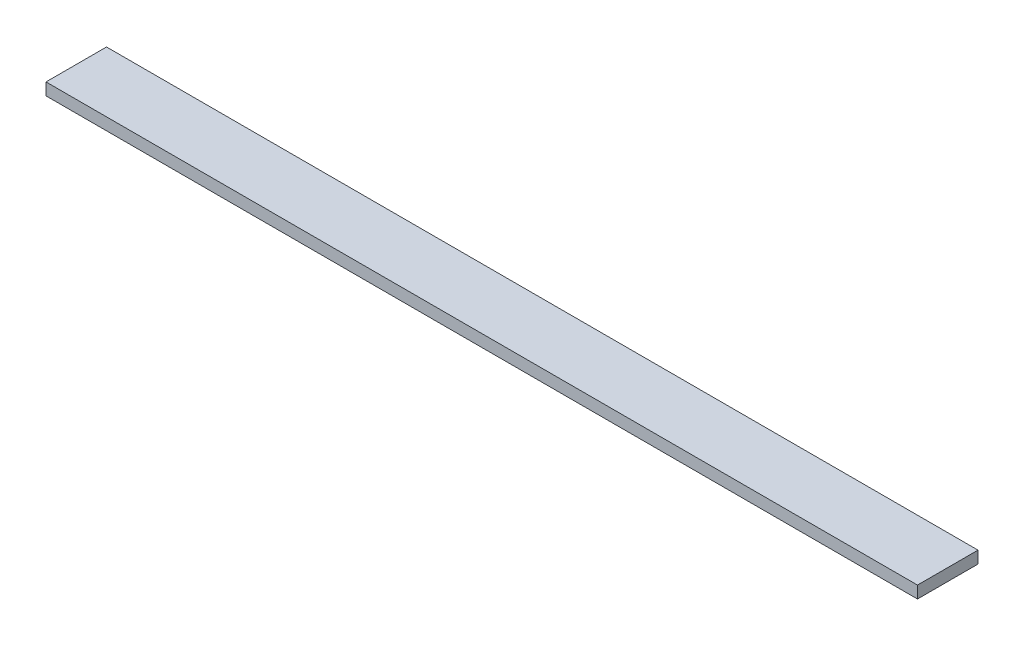
ISO-10303-21;
HEADER;
FILE_DESCRIPTION(('STEP AP214'),'2;1');
FILE_NAME('part.step','',(''),(''),'','','');
FILE_SCHEMA(('AUTOMOTIVE_DESIGN { 1 0 10303 214 1 1 1 1 }'));
ENDSEC;
DATA;
#1=APPLICATION_CONTEXT('core data for automotive mechanical design processes');
#2=APPLICATION_PROTOCOL_DEFINITION('international standard','automotive_design',2000,#1);
#3=PRODUCT_CONTEXT('',#1,'mechanical');
#4=PRODUCT('Part','Part','',(#3));
#5=PRODUCT_RELATED_PRODUCT_CATEGORY('part','',(#4));
#6=PRODUCT_DEFINITION_FORMATION('','',#4);
#7=PRODUCT_DEFINITION_CONTEXT('part definition',#1,'design');
#8=PRODUCT_DEFINITION('design','',#6,#7);
#9=PRODUCT_DEFINITION_SHAPE('','',#8);
#10=(LENGTH_UNIT() NAMED_UNIT(*) SI_UNIT(.MILLI.,.METRE.));
#11=(NAMED_UNIT(*) PLANE_ANGLE_UNIT() SI_UNIT($,.RADIAN.));
#12=(NAMED_UNIT(*) SI_UNIT($,.STERADIAN.) SOLID_ANGLE_UNIT());
#13=UNCERTAINTY_MEASURE_WITH_UNIT(LENGTH_MEASURE(1.E-05),#10,'distance_accuracy_value','');
#14=(GEOMETRIC_REPRESENTATION_CONTEXT(3) GLOBAL_UNCERTAINTY_ASSIGNED_CONTEXT((#13)) GLOBAL_UNIT_ASSIGNED_CONTEXT((#10,
#11,#12)) REPRESENTATION_CONTEXT('',''));
#15=CARTESIAN_POINT('',(0.,0.,0.));
#16=DIRECTION('',(0.,0.,1.));
#17=DIRECTION('',(1.,0.,0.));
#18=AXIS2_PLACEMENT_3D('',#15,#16,#17);
#19=CARTESIAN_POINT('',(0.,12.7,0.));
#20=DIRECTION('',(1.,0.,0.));
#21=DIRECTION('',(0.,0.,-1.));
#22=AXIS2_PLACEMENT_3D('',#19,#20,#21);
#23=PLANE('',#22);
#24=DIRECTION('',(0.,0.,1.));
#25=VECTOR('',#24,1.);
#26=CARTESIAN_POINT('',(0.,0.,0.));
#27=LINE('',#26,#25);
#28=CARTESIAN_POINT('',(0.,0.,-63.5));
#29=VERTEX_POINT('',#28);
#30=CARTESIAN_POINT('',(0.,0.,0.));
#31=VERTEX_POINT('',#30);
#32=EDGE_CURVE('E80',#29,#31,#27,.T.);
#33=ORIENTED_EDGE('',*,*,#32,.T.);
#34=DIRECTION('',(0.,-1.,0.));
#35=VECTOR('',#34,1.);
#36=CARTESIAN_POINT('',(0.,12.7,0.));
#37=LINE('',#36,#35);
#38=CARTESIAN_POINT('',(0.,12.7,0.));
#39=VERTEX_POINT('',#38);
#40=EDGE_CURVE('E11',#39,#31,#37,.T.);
#41=ORIENTED_EDGE('',*,*,#40,.F.);
#42=DIRECTION('',(0.,0.,1.));
#43=VECTOR('',#42,1.);
#44=CARTESIAN_POINT('',(0.,12.7,0.));
#45=LINE('',#44,#43);
#46=CARTESIAN_POINT('',(0.,12.7,-63.5));
#47=VERTEX_POINT('',#46);
#48=EDGE_CURVE('E68',#47,#39,#45,.T.);
#49=ORIENTED_EDGE('',*,*,#48,.F.);
#50=DIRECTION('',(0.,-1.,0.));
#51=VECTOR('',#50,1.);
#52=CARTESIAN_POINT('',(0.,12.7,-63.5));
#53=LINE('',#52,#51);
#54=EDGE_CURVE('E76',#47,#29,#53,.T.);
#55=ORIENTED_EDGE('',*,*,#54,.T.);
#56=EDGE_LOOP('',(#33,#41,#49,#55));
#57=FACE_BOUND('',#56,.T.);
#58=ADVANCED_FACE('F17',(#57),#23,.F.);
#59=CARTESIAN_POINT('',(0.,12.7,0.));
#60=DIRECTION('',(0.,0.,-1.));
#61=DIRECTION('',(-1.,0.,0.));
#62=AXIS2_PLACEMENT_3D('',#59,#60,#61);
#63=PLANE('',#62);
#64=DIRECTION('',(1.,0.,0.));
#65=VECTOR('',#64,1.);
#66=CARTESIAN_POINT('',(0.,0.,0.));
#67=LINE('',#66,#65);
#68=CARTESIAN_POINT('',(914.4,0.,0.));
#69=VERTEX_POINT('',#68);
#70=EDGE_CURVE('E72',#31,#69,#67,.T.);
#71=ORIENTED_EDGE('',*,*,#70,.T.);
#72=DIRECTION('',(0.,-1.,0.));
#73=VECTOR('',#72,1.);
#74=CARTESIAN_POINT('',(914.4,12.7,0.));
#75=LINE('',#74,#73);
#76=CARTESIAN_POINT('',(914.4,12.7,0.));
#77=VERTEX_POINT('',#76);
#78=EDGE_CURVE('E25',#77,#69,#75,.T.);
#79=ORIENTED_EDGE('',*,*,#78,.F.);
#80=DIRECTION('',(1.,0.,0.));
#81=VECTOR('',#80,1.);
#82=CARTESIAN_POINT('',(0.,12.7,0.));
#83=LINE('',#82,#81);
#84=EDGE_CURVE('E63',#39,#77,#83,.T.);
#85=ORIENTED_EDGE('',*,*,#84,.F.);
#86=ORIENTED_EDGE('',*,*,#40,.T.);
#87=EDGE_LOOP('',(#71,#79,#85,#86));
#88=FACE_BOUND('',#87,.T.);
#89=ADVANCED_FACE('F71',(#88),#63,.F.);
#90=CARTESIAN_POINT('',(914.4,12.7,0.));
#91=DIRECTION('',(-1.,0.,0.));
#92=DIRECTION('',(0.,0.,1.));
#93=AXIS2_PLACEMENT_3D('',#90,#91,#92);
#94=PLANE('',#93);
#95=DIRECTION('',(0.,0.,-1.));
#96=VECTOR('',#95,1.);
#97=CARTESIAN_POINT('',(914.4,0.,0.));
#98=LINE('',#97,#96);
#99=CARTESIAN_POINT('',(914.4,0.,-63.5));
#100=VERTEX_POINT('',#99);
#101=EDGE_CURVE('E50',#69,#100,#98,.T.);
#102=ORIENTED_EDGE('',*,*,#101,.T.);
#103=DIRECTION('',(0.,-1.,0.));
#104=VECTOR('',#103,1.);
#105=CARTESIAN_POINT('',(914.4,12.7,-63.5));
#106=LINE('',#105,#104);
#107=CARTESIAN_POINT('',(914.4,12.7,-63.5));
#108=VERTEX_POINT('',#107);
#109=EDGE_CURVE('E73',#108,#100,#106,.T.);
#110=ORIENTED_EDGE('',*,*,#109,.F.);
#111=DIRECTION('',(0.,0.,-1.));
#112=VECTOR('',#111,1.);
#113=CARTESIAN_POINT('',(914.4,12.7,0.));
#114=LINE('',#113,#112);
#115=EDGE_CURVE('E66',#77,#108,#114,.T.);
#116=ORIENTED_EDGE('',*,*,#115,.F.);
#117=ORIENTED_EDGE('',*,*,#78,.T.);
#118=EDGE_LOOP('',(#102,#110,#116,#117));
#119=FACE_BOUND('',#118,.T.);
#120=ADVANCED_FACE('F74',(#119),#94,.F.);
#121=CARTESIAN_POINT('',(0.,12.7,-63.5));
#122=DIRECTION('',(0.,0.,1.));
#123=DIRECTION('',(1.,0.,0.));
#124=AXIS2_PLACEMENT_3D('',#121,#122,#123);
#125=PLANE('',#124);
#126=DIRECTION('',(-1.,0.,0.));
#127=VECTOR('',#126,1.);
#128=CARTESIAN_POINT('',(0.,0.,-63.5));
#129=LINE('',#128,#127);
#130=EDGE_CURVE('E56',#100,#29,#129,.T.);
#131=ORIENTED_EDGE('',*,*,#130,.T.);
#132=ORIENTED_EDGE('',*,*,#54,.F.);
#133=DIRECTION('',(-1.,0.,0.));
#134=VECTOR('',#133,1.);
#135=CARTESIAN_POINT('',(0.,12.7,-63.5));
#136=LINE('',#135,#134);
#137=EDGE_CURVE('E33',#108,#47,#136,.T.);
#138=ORIENTED_EDGE('',*,*,#137,.F.);
#139=ORIENTED_EDGE('',*,*,#109,.T.);
#140=EDGE_LOOP('',(#131,#132,#138,#139));
#141=FACE_BOUND('',#140,.T.);
#142=ADVANCED_FACE('F87',(#141),#125,.F.);
#143=CARTESIAN_POINT('',(0.,12.7,-63.5));
#144=DIRECTION('',(0.,-1.,0.));
#145=DIRECTION('',(0.,0.,-1.));
#146=AXIS2_PLACEMENT_3D('',#143,#144,#145);
#147=PLANE('',#146);
#148=ORIENTED_EDGE('',*,*,#48,.T.);
#149=ORIENTED_EDGE('',*,*,#84,.T.);
#150=ORIENTED_EDGE('',*,*,#115,.T.);
#151=ORIENTED_EDGE('',*,*,#137,.T.);
#152=EDGE_LOOP('',(#148,#149,#150,#151));
#153=FACE_BOUND('',#152,.T.);
#154=ADVANCED_FACE('F64',(#153),#147,.F.);
#155=CARTESIAN_POINT('',(0.,0.,-63.5));
#156=DIRECTION('',(0.,-1.,0.));
#157=DIRECTION('',(0.,0.,-1.));
#158=AXIS2_PLACEMENT_3D('',#155,#156,#157);
#159=PLANE('',#158);
#160=ORIENTED_EDGE('',*,*,#32,.F.);
#161=ORIENTED_EDGE('',*,*,#130,.F.);
#162=ORIENTED_EDGE('',*,*,#101,.F.);
#163=ORIENTED_EDGE('',*,*,#70,.F.);
#164=EDGE_LOOP('',(#160,#161,#162,#163));
#165=FACE_BOUND('',#164,.T.);
#166=ADVANCED_FACE('F90',(#165),#159,.T.);
#167=CLOSED_SHELL('',(#58,#89,#120,#142,#154,#166));
#168=MANIFOLD_SOLID_BREP('B1',#167);
#169=ADVANCED_BREP_SHAPE_REPRESENTATION('',(#18,#168),#14);
#170=SHAPE_DEFINITION_REPRESENTATION(#9,#169);
ENDSEC;
END-ISO-10303-21;
